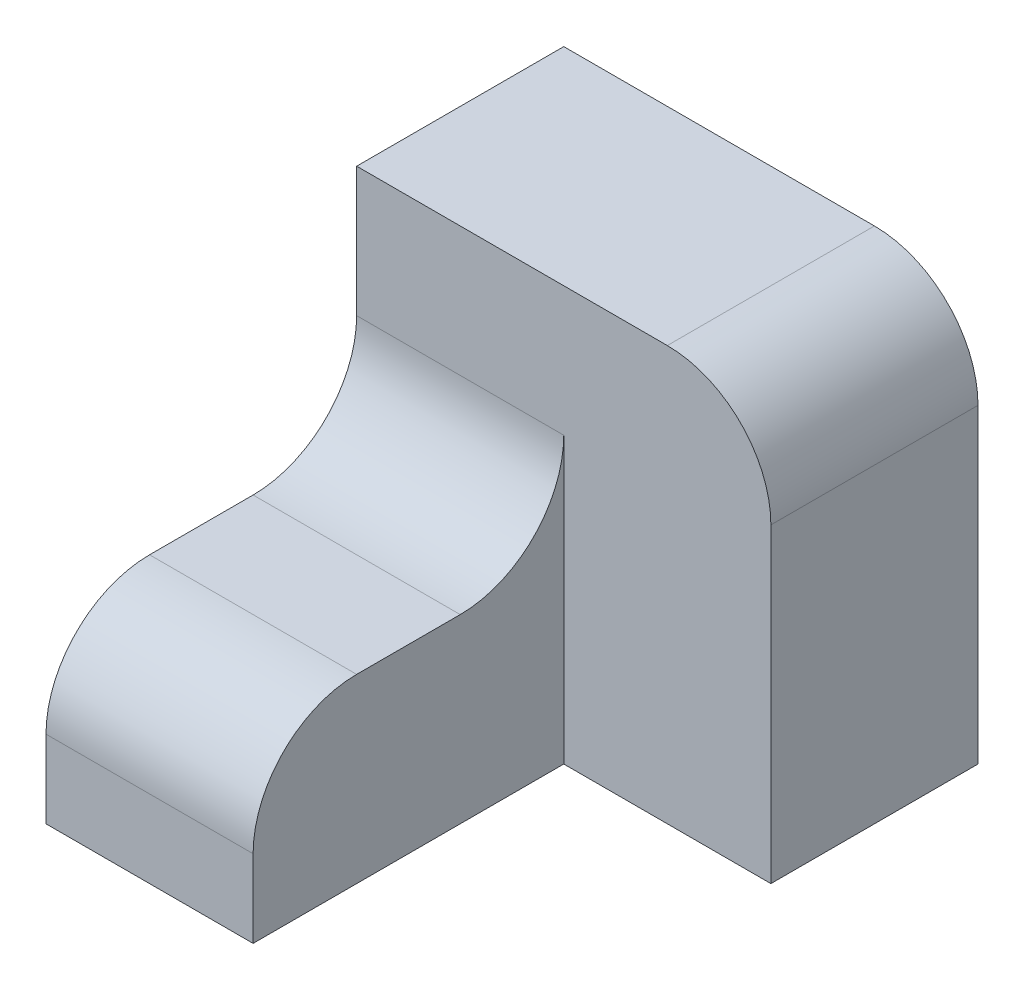
ISO-10303-21;
HEADER;
FILE_DESCRIPTION(('STEP AP214'),'2;1');
FILE_NAME('part.step','',(''),(''),'','','');
FILE_SCHEMA(('AUTOMOTIVE_DESIGN { 1 0 10303 214 1 1 1 1 }'));
ENDSEC;
DATA;
#1=APPLICATION_CONTEXT('core data for automotive mechanical design processes');
#2=APPLICATION_PROTOCOL_DEFINITION('international standard','automotive_design',2000,#1);
#3=PRODUCT_CONTEXT('',#1,'mechanical');
#4=PRODUCT('Part','Part','',(#3));
#5=PRODUCT_RELATED_PRODUCT_CATEGORY('part','',(#4));
#6=PRODUCT_DEFINITION_FORMATION('','',#4);
#7=PRODUCT_DEFINITION_CONTEXT('part definition',#1,'design');
#8=PRODUCT_DEFINITION('design','',#6,#7);
#9=PRODUCT_DEFINITION_SHAPE('','',#8);
#10=(LENGTH_UNIT() NAMED_UNIT(*) SI_UNIT(.MILLI.,.METRE.));
#11=(NAMED_UNIT(*) PLANE_ANGLE_UNIT() SI_UNIT($,.RADIAN.));
#12=(NAMED_UNIT(*) SI_UNIT($,.STERADIAN.) SOLID_ANGLE_UNIT());
#13=UNCERTAINTY_MEASURE_WITH_UNIT(LENGTH_MEASURE(1.E-05),#10,'distance_accuracy_value','');
#14=(GEOMETRIC_REPRESENTATION_CONTEXT(3) GLOBAL_UNCERTAINTY_ASSIGNED_CONTEXT((#13)) GLOBAL_UNIT_ASSIGNED_CONTEXT((#10,
#11,#12)) REPRESENTATION_CONTEXT('',''));
#15=CARTESIAN_POINT('',(0.,0.,0.));
#16=DIRECTION('',(0.,0.,1.));
#17=DIRECTION('',(1.,0.,0.));
#18=AXIS2_PLACEMENT_3D('',#15,#16,#17);
#19=CARTESIAN_POINT('',(-10.,0.,30.));
#20=DIRECTION('',(0.,-1.,0.));
#21=DIRECTION('',(1.,0.,0.));
#22=AXIS2_PLACEMENT_3D('',#19,#20,#21);
#23=PLANE('',#22);
#24=DIRECTION('',(0.,0.,-1.));
#25=VECTOR('',#24,1.);
#26=CARTESIAN_POINT('',(-10.,0.,30.));
#27=LINE('',#26,#25);
#28=CARTESIAN_POINT('',(-10.,0.,20.));
#29=VERTEX_POINT('',#28);
#30=CARTESIAN_POINT('',(-10.,0.,10.));
#31=VERTEX_POINT('',#30);
#32=EDGE_CURVE('E164',#29,#31,#27,.T.);
#33=ORIENTED_EDGE('',*,*,#32,.T.);
#34=DIRECTION('',(-1.,0.,0.));
#35=VECTOR('',#34,1.);
#36=CARTESIAN_POINT('',(-10.,0.,10.));
#37=LINE('',#36,#35);
#38=CARTESIAN_POINT('',(-30.,0.,10.));
#39=VERTEX_POINT('',#38);
#40=EDGE_CURVE('E178',#31,#39,#37,.T.);
#41=ORIENTED_EDGE('',*,*,#40,.T.);
#42=DIRECTION('',(0.,0.,-1.));
#43=VECTOR('',#42,1.);
#44=CARTESIAN_POINT('',(-30.,0.,30.));
#45=LINE('',#44,#43);
#46=CARTESIAN_POINT('',(-30.,0.,20.));
#47=VERTEX_POINT('',#46);
#48=EDGE_CURVE('E173',#47,#39,#45,.T.);
#49=ORIENTED_EDGE('',*,*,#48,.F.);
#50=DIRECTION('',(-1.,0.,0.));
#51=VECTOR('',#50,1.);
#52=CARTESIAN_POINT('',(-10.,0.,20.));
#53=LINE('',#52,#51);
#54=EDGE_CURVE('E176',#47,#29,#53,.F.);
#55=ORIENTED_EDGE('',*,*,#54,.T.);
#56=EDGE_LOOP('',(#33,#41,#49,#55));
#57=FACE_BOUND('',#56,.T.);
#58=ADVANCED_FACE('F35',(#57),#23,.F.);
#59=CARTESIAN_POINT('',(-30.,0.,30.));
#60=DIRECTION('',(1.,0.,0.));
#61=DIRECTION('',(0.,0.,-1.));
#62=AXIS2_PLACEMENT_3D('',#59,#60,#61);
#63=PLANE('',#62);
#64=DIRECTION('',(0.,-1.,0.));
#65=VECTOR('',#64,1.);
#66=CARTESIAN_POINT('',(-30.,0.,30.));
#67=LINE('',#66,#65);
#68=CARTESIAN_POINT('',(-30.,-10.,30.));
#69=VERTEX_POINT('',#68);
#70=CARTESIAN_POINT('',(-30.,-17.5,30.));
#71=VERTEX_POINT('',#70);
#72=EDGE_CURVE('E158',#69,#71,#67,.T.);
#73=ORIENTED_EDGE('',*,*,#72,.F.);
#74=CARTESIAN_POINT('',(-30.,-10.,20.));
#75=DIRECTION('',(1.,0.,0.));
#76=DIRECTION('',(0.,0.,-1.));
#77=AXIS2_PLACEMENT_3D('',#74,#75,#76);
#78=CIRCLE('',#77,10.);
#79=EDGE_CURVE('E58',#69,#47,#78,.F.);
#80=ORIENTED_EDGE('',*,*,#79,.T.);
#81=ORIENTED_EDGE('',*,*,#48,.T.);
#82=CARTESIAN_POINT('',(-30.,10.,10.));
#83=DIRECTION('',(1.,0.,0.));
#84=DIRECTION('',(0.,0.,-1.));
#85=AXIS2_PLACEMENT_3D('',#82,#83,#84);
#86=CIRCLE('',#85,10.);
#87=CARTESIAN_POINT('',(-30.,10.,0.));
#88=VERTEX_POINT('',#87);
#89=EDGE_CURVE('E43',#39,#88,#86,.T.);
#90=ORIENTED_EDGE('',*,*,#89,.T.);
#91=DIRECTION('',(0.,-1.,0.));
#92=VECTOR('',#91,1.);
#93=CARTESIAN_POINT('',(-30.,22.5,0.));
#94=LINE('',#93,#92);
#95=CARTESIAN_POINT('',(-30.,22.5,0.));
#96=VERTEX_POINT('',#95);
#97=EDGE_CURVE('E134',#96,#88,#94,.T.);
#98=ORIENTED_EDGE('',*,*,#97,.F.);
#99=DIRECTION('',(0.,0.,1.));
#100=VECTOR('',#99,1.);
#101=CARTESIAN_POINT('',(-30.,22.5,-20.));
#102=LINE('',#101,#100);
#103=CARTESIAN_POINT('',(-30.,22.5,-20.));
#104=VERTEX_POINT('',#103);
#105=EDGE_CURVE('E118',#104,#96,#102,.T.);
#106=ORIENTED_EDGE('',*,*,#105,.F.);
#107=DIRECTION('',(0.,-1.,0.));
#108=VECTOR('',#107,1.);
#109=CARTESIAN_POINT('',(-30.,22.5,-20.));
#110=LINE('',#109,#108);
#111=CARTESIAN_POINT('',(-30.,-17.5,-20.));
#112=VERTEX_POINT('',#111);
#113=EDGE_CURVE('E125',#104,#112,#110,.T.);
#114=ORIENTED_EDGE('',*,*,#113,.T.);
#115=DIRECTION('',(0.,0.,-1.));
#116=VECTOR('',#115,1.);
#117=CARTESIAN_POINT('',(-30.,-17.5,30.));
#118=LINE('',#117,#116);
#119=EDGE_CURVE('E171',#71,#112,#118,.T.);
#120=ORIENTED_EDGE('',*,*,#119,.F.);
#121=EDGE_LOOP('',(#73,#80,#81,#90,#98,#106,#114,#120));
#122=FACE_BOUND('',#121,.T.);
#123=ADVANCED_FACE('F131',(#122),#63,.F.);
#124=CARTESIAN_POINT('',(-30.,-17.5,30.));
#125=DIRECTION('',(0.,1.,0.));
#126=DIRECTION('',(0.,0.,1.));
#127=AXIS2_PLACEMENT_3D('',#124,#125,#126);
#128=PLANE('',#127);
#129=ORIENTED_EDGE('',*,*,#119,.T.);
#130=DIRECTION('',(1.,0.,0.));
#131=VECTOR('',#130,1.);
#132=CARTESIAN_POINT('',(-30.,-17.5,-20.));
#133=LINE('',#132,#131);
#134=CARTESIAN_POINT('',(10.,-17.5,-20.));
#135=VERTEX_POINT('',#134);
#136=EDGE_CURVE('E142',#112,#135,#133,.T.);
#137=ORIENTED_EDGE('',*,*,#136,.T.);
#138=DIRECTION('',(0.,0.,1.));
#139=VECTOR('',#138,1.);
#140=CARTESIAN_POINT('',(10.,-17.5,-20.));
#141=LINE('',#140,#139);
#142=CARTESIAN_POINT('',(10.,-17.5,0.));
#143=VERTEX_POINT('',#142);
#144=EDGE_CURVE('E135',#135,#143,#141,.T.);
#145=ORIENTED_EDGE('',*,*,#144,.T.);
#146=DIRECTION('',(1.,0.,0.));
#147=VECTOR('',#146,1.);
#148=CARTESIAN_POINT('',(-30.,-17.5,0.));
#149=LINE('',#148,#147);
#150=CARTESIAN_POINT('',(-10.,-17.5,0.));
#151=VERTEX_POINT('',#150);
#152=EDGE_CURVE('E151',#151,#143,#149,.T.);
#153=ORIENTED_EDGE('',*,*,#152,.F.);
#154=DIRECTION('',(0.,0.,-1.));
#155=VECTOR('',#154,1.);
#156=CARTESIAN_POINT('',(-10.,-17.5,30.));
#157=LINE('',#156,#155);
#158=CARTESIAN_POINT('',(-10.,-17.5,30.));
#159=VERTEX_POINT('',#158);
#160=EDGE_CURVE('E168',#159,#151,#157,.T.);
#161=ORIENTED_EDGE('',*,*,#160,.F.);
#162=DIRECTION('',(1.,0.,0.));
#163=VECTOR('',#162,1.);
#164=CARTESIAN_POINT('',(-30.,-17.5,30.));
#165=LINE('',#164,#163);
#166=EDGE_CURVE('E160',#71,#159,#165,.T.);
#167=ORIENTED_EDGE('',*,*,#166,.F.);
#168=EDGE_LOOP('',(#129,#137,#145,#153,#161,#167));
#169=FACE_BOUND('',#168,.T.);
#170=ADVANCED_FACE('F210',(#169),#128,.F.);
#171=CARTESIAN_POINT('',(-10.,-17.5,30.));
#172=DIRECTION('',(-1.,0.,0.));
#173=DIRECTION('',(0.,0.,1.));
#174=AXIS2_PLACEMENT_3D('',#171,#172,#173);
#175=PLANE('',#174);
#176=ORIENTED_EDGE('',*,*,#32,.F.);
#177=CARTESIAN_POINT('',(-10.,-10.,20.));
#178=DIRECTION('',(-1.,0.,0.));
#179=DIRECTION('',(0.,0.,1.));
#180=AXIS2_PLACEMENT_3D('',#177,#178,#179);
#181=CIRCLE('',#180,10.);
#182=CARTESIAN_POINT('',(-10.,-10.,30.));
#183=VERTEX_POINT('',#182);
#184=EDGE_CURVE('E50',#29,#183,#181,.F.);
#185=ORIENTED_EDGE('',*,*,#184,.T.);
#186=DIRECTION('',(0.,1.,0.));
#187=VECTOR('',#186,1.);
#188=CARTESIAN_POINT('',(-10.,-17.5,30.));
#189=LINE('',#188,#187);
#190=EDGE_CURVE('E162',#159,#183,#189,.T.);
#191=ORIENTED_EDGE('',*,*,#190,.F.);
#192=ORIENTED_EDGE('',*,*,#160,.T.);
#193=DIRECTION('',(0.,1.,0.));
#194=VECTOR('',#193,1.);
#195=CARTESIAN_POINT('',(-10.,-17.5,0.));
#196=LINE('',#195,#194);
#197=CARTESIAN_POINT('',(-10.,10.,0.));
#198=VERTEX_POINT('',#197);
#199=EDGE_CURVE('E156',#151,#198,#196,.T.);
#200=ORIENTED_EDGE('',*,*,#199,.T.);
#201=CARTESIAN_POINT('',(-10.,10.,10.));
#202=DIRECTION('',(-1.,0.,0.));
#203=DIRECTION('',(0.,0.,1.));
#204=AXIS2_PLACEMENT_3D('',#201,#202,#203);
#205=CIRCLE('',#204,10.);
#206=EDGE_CURVE('E11',#198,#31,#205,.T.);
#207=ORIENTED_EDGE('',*,*,#206,.T.);
#208=EDGE_LOOP('',(#176,#185,#191,#192,#200,#207));
#209=FACE_BOUND('',#208,.T.);
#210=ADVANCED_FACE('F203',(#209),#175,.F.);
#211=CARTESIAN_POINT('',(0.,0.,30.));
#212=DIRECTION('',(0.,0.,1.));
#213=DIRECTION('',(1.,0.,0.));
#214=AXIS2_PLACEMENT_3D('',#211,#212,#213);
#215=PLANE('',#214);
#216=ORIENTED_EDGE('',*,*,#190,.T.);
#217=DIRECTION('',(-1.,0.,0.));
#218=VECTOR('',#217,1.);
#219=CARTESIAN_POINT('',(-30.,-10.,30.));
#220=LINE('',#219,#218);
#221=EDGE_CURVE('E192',#183,#69,#220,.T.);
#222=ORIENTED_EDGE('',*,*,#221,.T.);
#223=ORIENTED_EDGE('',*,*,#72,.T.);
#224=ORIENTED_EDGE('',*,*,#166,.T.);
#225=EDGE_LOOP('',(#216,#222,#223,#224));
#226=FACE_BOUND('',#225,.T.);
#227=ADVANCED_FACE('F206',(#226),#215,.T.);
#228=CARTESIAN_POINT('',(0.,0.,0.));
#229=DIRECTION('',(0.,0.,1.));
#230=DIRECTION('',(1.,0.,0.));
#231=AXIS2_PLACEMENT_3D('',#228,#229,#230);
#232=PLANE('',#231);
#233=ORIENTED_EDGE('',*,*,#97,.T.);
#234=DIRECTION('',(-1.,0.,0.));
#235=VECTOR('',#234,1.);
#236=CARTESIAN_POINT('',(0.,10.,0.));
#237=LINE('',#236,#235);
#238=EDGE_CURVE('E183',#88,#198,#237,.F.);
#239=ORIENTED_EDGE('',*,*,#238,.T.);
#240=ORIENTED_EDGE('',*,*,#199,.F.);
#241=ORIENTED_EDGE('',*,*,#152,.T.);
#242=DIRECTION('',(0.,1.,0.));
#243=VECTOR('',#242,1.);
#244=CARTESIAN_POINT('',(10.,-17.5,0.));
#245=LINE('',#244,#243);
#246=CARTESIAN_POINT('',(10.,12.5,0.));
#247=VERTEX_POINT('',#246);
#248=EDGE_CURVE('E126',#143,#247,#245,.T.);
#249=ORIENTED_EDGE('',*,*,#248,.T.);
#250=CARTESIAN_POINT('',(0.,12.5,0.));
#251=DIRECTION('',(0.,0.,1.));
#252=DIRECTION('',(1.,0.,0.));
#253=AXIS2_PLACEMENT_3D('',#250,#251,#252);
#254=CIRCLE('',#253,10.);
#255=CARTESIAN_POINT('',(0.,22.5,0.));
#256=VERTEX_POINT('',#255);
#257=EDGE_CURVE('E181',#247,#256,#254,.T.);
#258=ORIENTED_EDGE('',*,*,#257,.T.);
#259=DIRECTION('',(-1.,0.,0.));
#260=VECTOR('',#259,1.);
#261=CARTESIAN_POINT('',(10.,22.5,0.));
#262=LINE('',#261,#260);
#263=EDGE_CURVE('E148',#256,#96,#262,.T.);
#264=ORIENTED_EDGE('',*,*,#263,.T.);
#265=EDGE_LOOP('',(#233,#239,#240,#241,#249,#258,#264));
#266=FACE_BOUND('',#265,.T.);
#267=ADVANCED_FACE('F200',(#266),#232,.T.);
#268=CARTESIAN_POINT('',(10.,22.5,-20.));
#269=DIRECTION('',(0.,1.,0.));
#270=DIRECTION('',(-1.,0.,0.));
#271=AXIS2_PLACEMENT_3D('',#268,#269,#270);
#272=PLANE('',#271);
#273=ORIENTED_EDGE('',*,*,#263,.F.);
#274=DIRECTION('',(0.,0.,1.));
#275=VECTOR('',#274,1.);
#276=CARTESIAN_POINT('',(0.,22.5,-20.));
#277=LINE('',#276,#275);
#278=CARTESIAN_POINT('',(0.,22.5,-20.));
#279=VERTEX_POINT('',#278);
#280=EDGE_CURVE('E121',#256,#279,#277,.F.);
#281=ORIENTED_EDGE('',*,*,#280,.T.);
#282=DIRECTION('',(-1.,0.,0.));
#283=VECTOR('',#282,1.);
#284=CARTESIAN_POINT('',(10.,22.5,-20.));
#285=LINE('',#284,#283);
#286=EDGE_CURVE('E114',#279,#104,#285,.T.);
#287=ORIENTED_EDGE('',*,*,#286,.T.);
#288=ORIENTED_EDGE('',*,*,#105,.T.);
#289=EDGE_LOOP('',(#273,#281,#287,#288));
#290=FACE_BOUND('',#289,.T.);
#291=ADVANCED_FACE('F117',(#290),#272,.T.);
#292=CARTESIAN_POINT('',(10.,-17.5,-20.));
#293=DIRECTION('',(1.,0.,0.));
#294=DIRECTION('',(0.,0.,-1.));
#295=AXIS2_PLACEMENT_3D('',#292,#293,#294);
#296=PLANE('',#295);
#297=DIRECTION('',(0.,1.,0.));
#298=VECTOR('',#297,1.);
#299=CARTESIAN_POINT('',(10.,-17.5,-20.));
#300=LINE('',#299,#298);
#301=CARTESIAN_POINT('',(10.,12.5,-20.));
#302=VERTEX_POINT('',#301);
#303=EDGE_CURVE('E136',#135,#302,#300,.T.);
#304=ORIENTED_EDGE('',*,*,#303,.T.);
#305=DIRECTION('',(0.,0.,1.));
#306=VECTOR('',#305,1.);
#307=CARTESIAN_POINT('',(10.,12.5,-20.));
#308=LINE('',#307,#306);
#309=EDGE_CURVE('E186',#302,#247,#308,.T.);
#310=ORIENTED_EDGE('',*,*,#309,.T.);
#311=ORIENTED_EDGE('',*,*,#248,.F.);
#312=ORIENTED_EDGE('',*,*,#144,.F.);
#313=EDGE_LOOP('',(#304,#310,#311,#312));
#314=FACE_BOUND('',#313,.T.);
#315=ADVANCED_FACE('F214',(#314),#296,.T.);
#316=CARTESIAN_POINT('',(0.,0.,-20.));
#317=DIRECTION('',(0.,0.,1.));
#318=DIRECTION('',(1.,0.,0.));
#319=AXIS2_PLACEMENT_3D('',#316,#317,#318);
#320=PLANE('',#319);
#321=ORIENTED_EDGE('',*,*,#286,.F.);
#322=CARTESIAN_POINT('',(0.,12.5,-20.));
#323=DIRECTION('',(0.,0.,1.));
#324=DIRECTION('',(1.,0.,0.));
#325=AXIS2_PLACEMENT_3D('',#322,#323,#324);
#326=CIRCLE('',#325,10.);
#327=EDGE_CURVE('E190',#279,#302,#326,.F.);
#328=ORIENTED_EDGE('',*,*,#327,.T.);
#329=ORIENTED_EDGE('',*,*,#303,.F.);
#330=ORIENTED_EDGE('',*,*,#136,.F.);
#331=ORIENTED_EDGE('',*,*,#113,.F.);
#332=EDGE_LOOP('',(#321,#328,#329,#330,#331));
#333=FACE_BOUND('',#332,.T.);
#334=ADVANCED_FACE('F139',(#333),#320,.F.);
#335=CARTESIAN_POINT('',(-10.,10.,10.));
#336=DIRECTION('',(-1.,0.,0.));
#337=DIRECTION('',(0.,-1.,0.));
#338=AXIS2_PLACEMENT_3D('',#335,#336,#337);
#339=CYLINDRICAL_SURFACE('',#338,10.);
#340=ORIENTED_EDGE('',*,*,#206,.F.);
#341=ORIENTED_EDGE('',*,*,#238,.F.);
#342=ORIENTED_EDGE('',*,*,#89,.F.);
#343=ORIENTED_EDGE('',*,*,#40,.F.);
#344=EDGE_LOOP('',(#340,#341,#342,#343));
#345=FACE_BOUND('',#344,.T.);
#346=ADVANCED_FACE('F202',(#345),#339,.F.);
#347=CARTESIAN_POINT('',(0.,12.5,-20.));
#348=DIRECTION('',(0.,0.,1.));
#349=DIRECTION('',(1.,0.,0.));
#350=AXIS2_PLACEMENT_3D('',#347,#348,#349);
#351=CYLINDRICAL_SURFACE('',#350,10.);
#352=ORIENTED_EDGE('',*,*,#327,.F.);
#353=ORIENTED_EDGE('',*,*,#280,.F.);
#354=ORIENTED_EDGE('',*,*,#257,.F.);
#355=ORIENTED_EDGE('',*,*,#309,.F.);
#356=EDGE_LOOP('',(#352,#353,#354,#355));
#357=FACE_BOUND('',#356,.T.);
#358=ADVANCED_FACE('F217',(#357),#351,.T.);
#359=CARTESIAN_POINT('',(0.,-10.,20.));
#360=DIRECTION('',(1.,0.,0.));
#361=DIRECTION('',(0.,1.,0.));
#362=AXIS2_PLACEMENT_3D('',#359,#360,#361);
#363=CYLINDRICAL_SURFACE('',#362,10.);
#364=ORIENTED_EDGE('',*,*,#184,.F.);
#365=ORIENTED_EDGE('',*,*,#54,.F.);
#366=ORIENTED_EDGE('',*,*,#79,.F.);
#367=ORIENTED_EDGE('',*,*,#221,.F.);
#368=EDGE_LOOP('',(#364,#365,#366,#367));
#369=FACE_BOUND('',#368,.T.);
#370=ADVANCED_FACE('F37',(#369),#363,.T.);
#371=CLOSED_SHELL('',(#58,#123,#170,#210,#227,#267,#291,#315,#334,#346,#358,#370));
#372=MANIFOLD_SOLID_BREP('B2',#371);
#373=ADVANCED_BREP_SHAPE_REPRESENTATION('',(#18,#372),#14);
#374=SHAPE_DEFINITION_REPRESENTATION(#9,#373);
ENDSEC;
END-ISO-10303-21;
